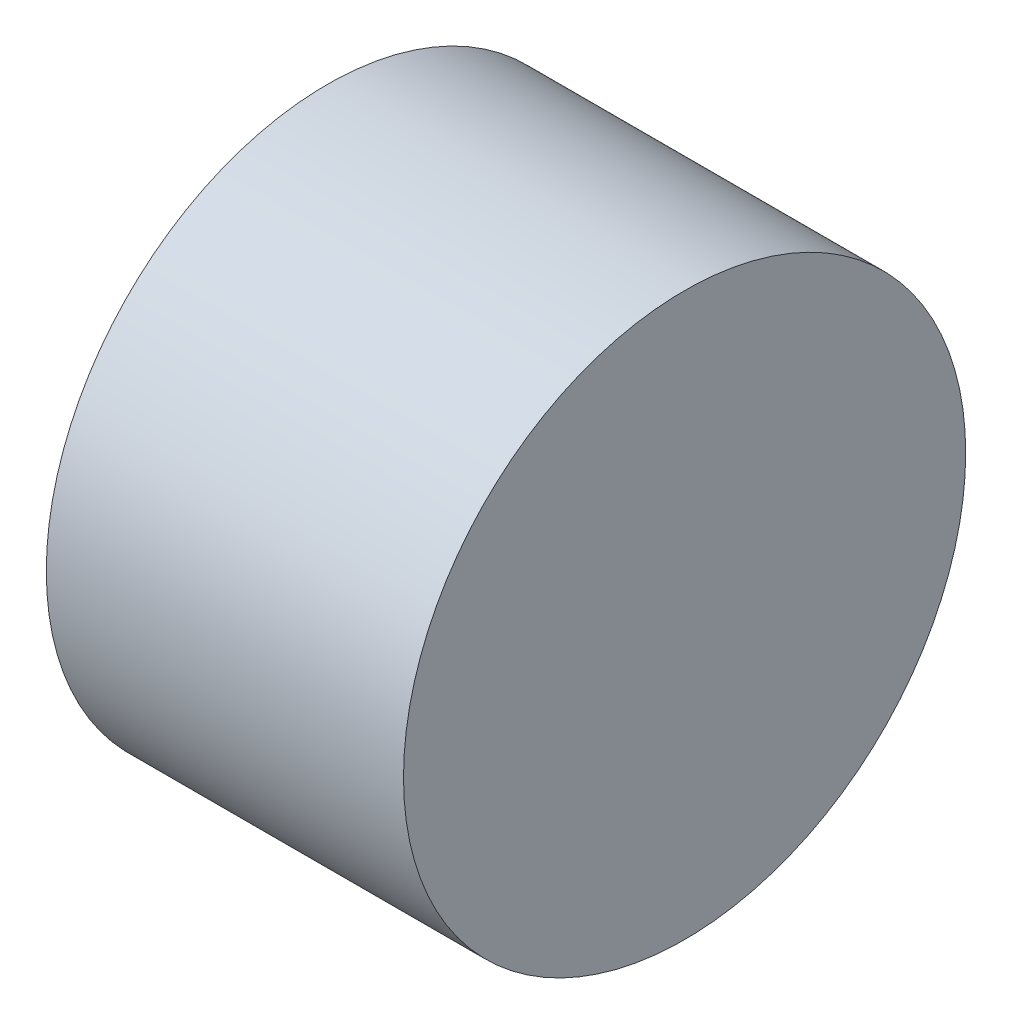
ISO-10303-21;
HEADER;
FILE_DESCRIPTION(('STEP AP214'),'2;1');
FILE_NAME('part.step','',(''),(''),'','','');
FILE_SCHEMA(('AUTOMOTIVE_DESIGN { 1 0 10303 214 1 1 1 1 }'));
ENDSEC;
DATA;
#1=APPLICATION_CONTEXT('core data for automotive mechanical design processes');
#2=APPLICATION_PROTOCOL_DEFINITION('international standard','automotive_design',2000,#1);
#3=PRODUCT_CONTEXT('',#1,'mechanical');
#4=PRODUCT('Part','Part','',(#3));
#5=PRODUCT_RELATED_PRODUCT_CATEGORY('part','',(#4));
#6=PRODUCT_DEFINITION_FORMATION('','',#4);
#7=PRODUCT_DEFINITION_CONTEXT('part definition',#1,'design');
#8=PRODUCT_DEFINITION('design','',#6,#7);
#9=PRODUCT_DEFINITION_SHAPE('','',#8);
#10=(LENGTH_UNIT() NAMED_UNIT(*) SI_UNIT(.MILLI.,.METRE.));
#11=(NAMED_UNIT(*) PLANE_ANGLE_UNIT() SI_UNIT($,.RADIAN.));
#12=(NAMED_UNIT(*) SI_UNIT($,.STERADIAN.) SOLID_ANGLE_UNIT());
#13=UNCERTAINTY_MEASURE_WITH_UNIT(LENGTH_MEASURE(1.E-05),#10,'distance_accuracy_value','');
#14=(GEOMETRIC_REPRESENTATION_CONTEXT(3) GLOBAL_UNCERTAINTY_ASSIGNED_CONTEXT((#13)) GLOBAL_UNIT_ASSIGNED_CONTEXT((#10,
#11,#12)) REPRESENTATION_CONTEXT('',''));
#15=CARTESIAN_POINT('',(0.,0.,0.));
#16=DIRECTION('',(0.,0.,1.));
#17=DIRECTION('',(1.,0.,0.));
#18=AXIS2_PLACEMENT_3D('',#15,#16,#17);
#19=CARTESIAN_POINT('',(8.255,0.,0.));
#20=DIRECTION('',(1.,0.,0.));
#21=DIRECTION('',(0.,0.,-1.));
#22=AXIS2_PLACEMENT_3D('',#19,#20,#21);
#23=PLANE('',#22);
#24=CARTESIAN_POINT('',(8.255,0.,0.));
#25=DIRECTION('',(-1.,0.,0.));
#26=DIRECTION('',(0.,-1.,0.));
#27=AXIS2_PLACEMENT_3D('',#24,#25,#26);
#28=CIRCLE('',#27,3.71475);
#29=CARTESIAN_POINT('',(8.255,-3.71475,0.));
#30=VERTEX_POINT('',#29);
#31=EDGE_CURVE('E47',#30,#30,#28,.T.);
#32=ORIENTED_EDGE('',*,*,#31,.F.);
#33=EDGE_LOOP('',(#32));
#34=FACE_BOUND('',#33,.T.);
#35=CARTESIAN_POINT('',(8.255,0.,0.));
#36=DIRECTION('',(-1.,0.,0.));
#37=DIRECTION('',(0.,0.,1.));
#38=AXIS2_PLACEMENT_3D('',#35,#36,#37);
#39=CIRCLE('',#38,18.1);
#40=CARTESIAN_POINT('',(8.255,0.,18.1));
#41=VERTEX_POINT('',#40);
#42=EDGE_CURVE('E10',#41,#41,#39,.T.);
#43=ORIENTED_EDGE('',*,*,#42,.T.);
#44=EDGE_LOOP('',(#43));
#45=FACE_BOUND('',#44,.T.);
#46=ADVANCED_FACE('F33',(#34,#45),#23,.F.);
#47=CARTESIAN_POINT('',(8.255,0.,0.));
#48=DIRECTION('',(-1.,0.,0.));
#49=DIRECTION('',(0.,0.,1.));
#50=AXIS2_PLACEMENT_3D('',#47,#48,#49);
#51=CYLINDRICAL_SURFACE('',#50,18.1);
#52=ORIENTED_EDGE('',*,*,#42,.F.);
#53=EDGE_LOOP('',(#52));
#54=FACE_BOUND('',#53,.T.);
#55=CARTESIAN_POINT('',(31.255,0.,0.));
#56=DIRECTION('',(-1.,0.,0.));
#57=DIRECTION('',(0.,0.,1.));
#58=AXIS2_PLACEMENT_3D('',#55,#56,#57);
#59=CIRCLE('',#58,18.1);
#60=CARTESIAN_POINT('',(31.255,0.,18.1));
#61=VERTEX_POINT('',#60);
#62=EDGE_CURVE('E39',#61,#61,#59,.T.);
#63=ORIENTED_EDGE('',*,*,#62,.T.);
#64=EDGE_LOOP('',(#63));
#65=FACE_BOUND('',#64,.T.);
#66=ADVANCED_FACE('F56',(#54,#65),#51,.T.);
#67=CARTESIAN_POINT('',(31.255,18.1,0.));
#68=DIRECTION('',(-1.,0.,0.));
#69=DIRECTION('',(0.,0.,1.));
#70=AXIS2_PLACEMENT_3D('',#67,#68,#69);
#71=PLANE('',#70);
#72=ORIENTED_EDGE('',*,*,#62,.F.);
#73=EDGE_LOOP('',(#72));
#74=FACE_BOUND('',#73,.T.);
#75=ADVANCED_FACE('F60',(#74),#71,.F.);
#76=CARTESIAN_POINT('',(16.8275,0.,0.));
#77=DIRECTION('',(-1.,0.,0.));
#78=DIRECTION('',(0.,-1.,0.));
#79=AXIS2_PLACEMENT_3D('',#76,#77,#78);
#80=CYLINDRICAL_SURFACE('',#79,3.71475);
#81=CARTESIAN_POINT('',(16.8275,0.,0.));
#82=DIRECTION('',(-1.,0.,0.));
#83=DIRECTION('',(0.,-1.,0.));
#84=AXIS2_PLACEMENT_3D('',#81,#82,#83);
#85=CIRCLE('',#84,3.71475);
#86=CARTESIAN_POINT('',(16.8275,-3.71474999999999,0.));
#87=VERTEX_POINT('',#86);
#88=EDGE_CURVE('E43',#87,#87,#85,.T.);
#89=ORIENTED_EDGE('',*,*,#88,.F.);
#90=EDGE_LOOP('',(#89));
#91=FACE_BOUND('',#90,.T.);
#92=ORIENTED_EDGE('',*,*,#31,.T.);
#93=EDGE_LOOP('',(#92));
#94=FACE_BOUND('',#93,.T.);
#95=ADVANCED_FACE('F53',(#91,#94),#80,.F.);
#96=CARTESIAN_POINT('',(16.8275,0.,0.));
#97=DIRECTION('',(-1.,0.,0.));
#98=DIRECTION('',(0.,-1.,0.));
#99=AXIS2_PLACEMENT_3D('',#96,#97,#98);
#100=PLANE('',#99);
#101=ORIENTED_EDGE('',*,*,#88,.T.);
#102=EDGE_LOOP('',(#101));
#103=FACE_BOUND('',#102,.T.);
#104=ADVANCED_FACE('F70',(#103),#100,.T.);
#105=CLOSED_SHELL('',(#46,#66,#75,#95,#104));
#106=MANIFOLD_SOLID_BREP('B2',#105);
#107=ADVANCED_BREP_SHAPE_REPRESENTATION('',(#18,#106),#14);
#108=SHAPE_DEFINITION_REPRESENTATION(#9,#107);
ENDSEC;
END-ISO-10303-21;
